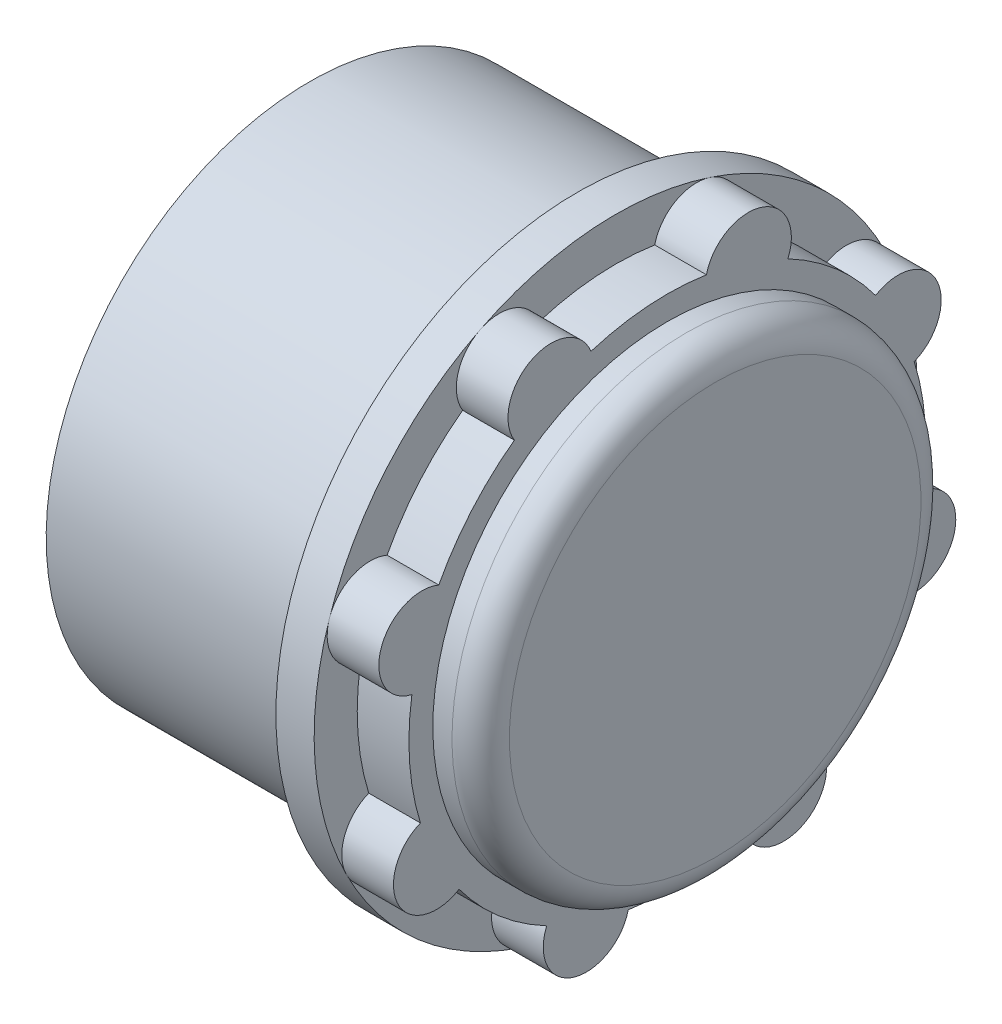
ISO-10303-21;
HEADER;
FILE_DESCRIPTION(('STEP AP214'),'2;1');
FILE_NAME('part.step','',(''),(''),'','','');
FILE_SCHEMA(('AUTOMOTIVE_DESIGN { 1 0 10303 214 1 1 1 1 }'));
ENDSEC;
DATA;
#1=APPLICATION_CONTEXT('core data for automotive mechanical design processes');
#2=APPLICATION_PROTOCOL_DEFINITION('international standard','automotive_design',2000,#1);
#3=PRODUCT_CONTEXT('',#1,'mechanical');
#4=PRODUCT('Part','Part','',(#3));
#5=PRODUCT_RELATED_PRODUCT_CATEGORY('part','',(#4));
#6=PRODUCT_DEFINITION_FORMATION('','',#4);
#7=PRODUCT_DEFINITION_CONTEXT('part definition',#1,'design');
#8=PRODUCT_DEFINITION('design','',#6,#7);
#9=PRODUCT_DEFINITION_SHAPE('','',#8);
#10=(LENGTH_UNIT() NAMED_UNIT(*) SI_UNIT(.MILLI.,.METRE.));
#11=(NAMED_UNIT(*) PLANE_ANGLE_UNIT() SI_UNIT($,.RADIAN.));
#12=(NAMED_UNIT(*) SI_UNIT($,.STERADIAN.) SOLID_ANGLE_UNIT());
#13=UNCERTAINTY_MEASURE_WITH_UNIT(LENGTH_MEASURE(1.E-05),#10,'distance_accuracy_value','');
#14=(GEOMETRIC_REPRESENTATION_CONTEXT(3) GLOBAL_UNCERTAINTY_ASSIGNED_CONTEXT((#13)) GLOBAL_UNIT_ASSIGNED_CONTEXT((#10,
#11,#12)) REPRESENTATION_CONTEXT('',''));
#15=CARTESIAN_POINT('',(0.,0.,0.));
#16=DIRECTION('',(0.,0.,1.));
#17=DIRECTION('',(1.,0.,0.));
#18=AXIS2_PLACEMENT_3D('',#15,#16,#17);
#19=CARTESIAN_POINT('',(2.,0.,0.));
#20=DIRECTION('',(1.,0.,0.));
#21=DIRECTION('',(0.,0.,-1.));
#22=AXIS2_PLACEMENT_3D('',#19,#20,#21);
#23=PLANE('',#22);
#24=CARTESIAN_POINT('',(2.,0.,0.));
#25=DIRECTION('',(1.,0.,0.));
#26=DIRECTION('',(0.,1.,0.));
#27=AXIS2_PLACEMENT_3D('',#24,#25,#26);
#28=CIRCLE('',#27,13.5);
#29=CARTESIAN_POINT('',(2.,-2.0425042619632,-13.3445935247149));
#30=VERTEX_POINT('',#29);
#31=CARTESIAN_POINT('',(2.,3.9869170359937,-12.8978483689375));
#32=VERTEX_POINT('',#31);
#33=EDGE_CURVE('E775',#30,#32,#28,.T.);
#34=ORIENTED_EDGE('',*,*,#33,.F.);
#35=CARTESIAN_POINT('',(2.,-4.23049904831431,-12.8200186350181));
#36=DIRECTION('',(1.,0.,0.));
#37=DIRECTION('',(0.,1.,0.));
#38=AXIS2_PLACEMENT_3D('',#35,#36,#37);
#39=CIRCLE('',#38,2.25);
#40=CARTESIAN_POINT('',(2.,-4.93558222303336,-14.9566884075211));
#41=VERTEX_POINT('',#40);
#42=EDGE_CURVE('E407',#41,#30,#39,.T.);
#43=ORIENTED_EDGE('',*,*,#42,.F.);
#44=CARTESIAN_POINT('',(2.,0.,0.));
#45=DIRECTION('',(1.,0.,0.));
#46=DIRECTION('',(0.,0.,-1.));
#47=AXIS2_PLACEMENT_3D('',#44,#45,#46);
#48=CIRCLE('',#47,15.75);
#49=CARTESIAN_POINT('',(2.,7.08599213804178,-14.0659594560631));
#50=VERTEX_POINT('',#49);
#51=EDGE_CURVE('E225',#41,#50,#48,.T.);
#52=ORIENTED_EDGE('',*,*,#51,.T.);
#53=CARTESIAN_POINT('',(2.,6.07370754689295,-12.0565366766255));
#54=DIRECTION('',(1.,0.,0.));
#55=DIRECTION('',(0.,1.,0.));
#56=AXIS2_PLACEMENT_3D('',#53,#54,#55);
#57=CIRCLE('',#56,2.25);
#58=EDGE_CURVE('E774',#32,#50,#57,.T.);
#59=ORIENTED_EDGE('',*,*,#58,.F.);
#60=EDGE_LOOP('',(#34,#43,#52,#59));
#61=FACE_BOUND('',#60,.T.);
#62=ADVANCED_FACE('F51',(#61),#23,.T.);
#63=CARTESIAN_POINT('',(2.,7.9917839592674,-10.8803211877406));
#64=VERTEX_POINT('',#63);
#65=EDGE_CURVE('E741',#50,#64,#57,.T.);
#66=ORIENTED_EDGE('',*,*,#65,.F.);
#67=CARTESIAN_POINT('',(2.,14.9566884075212,-4.93558222303331));
#68=VERTEX_POINT('',#67);
#69=EDGE_CURVE('E232',#50,#68,#48,.T.);
#70=ORIENTED_EDGE('',*,*,#69,.T.);
#71=CARTESIAN_POINT('',(2.,12.8200186350181,-4.23049904831426));
#72=DIRECTION('',(1.,0.,0.));
#73=DIRECTION('',(0.,1.,0.));
#74=AXIS2_PLACEMENT_3D('',#71,#72,#73);
#75=CIRCLE('',#74,2.25000000000001);
#76=CARTESIAN_POINT('',(2.,11.9393321165709,-6.30097997221221));
#77=VERTEX_POINT('',#76);
#78=EDGE_CURVE('E330',#77,#68,#75,.T.);
#79=ORIENTED_EDGE('',*,*,#78,.F.);
#80=CARTESIAN_POINT('',(2.,0.,0.));
#81=DIRECTION('',(1.,0.,0.));
#82=DIRECTION('',(0.,1.,0.));
#83=AXIS2_PLACEMENT_3D('',#80,#81,#82);
#84=CIRCLE('',#83,13.5);
#85=EDGE_CURVE('E738',#64,#77,#84,.T.);
#86=ORIENTED_EDGE('',*,*,#85,.F.);
#87=EDGE_LOOP('',(#66,#70,#79,#86));
#88=FACE_BOUND('',#87,.T.);
#89=ADVANCED_FACE('F261',(#88),#23,.T.);
#90=CARTESIAN_POINT('',(2.,-6.30097997221226,-11.9393321165708));
#91=VERTEX_POINT('',#90);
#92=EDGE_CURVE('E778',#91,#41,#39,.T.);
#93=ORIENTED_EDGE('',*,*,#92,.F.);
#94=CARTESIAN_POINT('',(2.,0.,0.));
#95=DIRECTION('',(1.,0.,0.));
#96=DIRECTION('',(0.,1.,0.));
#97=AXIS2_PLACEMENT_3D('',#94,#95,#96);
#98=CIRCLE('',#97,13.5);
#99=CARTESIAN_POINT('',(2.,-10.8803211877406,-7.99178395926736));
#100=VERTEX_POINT('',#99);
#101=EDGE_CURVE('E787',#100,#91,#98,.T.);
#102=ORIENTED_EDGE('',*,*,#101,.F.);
#103=CARTESIAN_POINT('',(2.,-12.0565366766255,-6.07370754689291));
#104=DIRECTION('',(1.,0.,0.));
#105=DIRECTION('',(0.,1.,0.));
#106=AXIS2_PLACEMENT_3D('',#103,#104,#105);
#107=CIRCLE('',#106,2.25);
#108=CARTESIAN_POINT('',(2.,-14.0659594560631,-7.08599213804173));
#109=VERTEX_POINT('',#108);
#110=EDGE_CURVE('E783',#109,#100,#107,.T.);
#111=ORIENTED_EDGE('',*,*,#110,.F.);
#112=EDGE_CURVE('E761',#109,#41,#48,.T.);
#113=ORIENTED_EDGE('',*,*,#112,.T.);
#114=EDGE_LOOP('',(#93,#102,#111,#113));
#115=FACE_BOUND('',#114,.T.);
#116=ADVANCED_FACE('F268',(#115),#23,.T.);
#117=CARTESIAN_POINT('',(2.,-12.8978483689375,-3.98691703599366));
#118=VERTEX_POINT('',#117);
#119=EDGE_CURVE('E792',#118,#109,#107,.T.);
#120=ORIENTED_EDGE('',*,*,#119,.F.);
#121=CARTESIAN_POINT('',(2.,0.,0.));
#122=DIRECTION('',(1.,0.,0.));
#123=DIRECTION('',(0.,1.,0.));
#124=AXIS2_PLACEMENT_3D('',#121,#122,#123);
#125=CIRCLE('',#124,13.5);
#126=CARTESIAN_POINT('',(2.,-13.3445935247149,2.04250426196324));
#127=VERTEX_POINT('',#126);
#128=EDGE_CURVE('E798',#127,#118,#125,.T.);
#129=ORIENTED_EDGE('',*,*,#128,.F.);
#130=CARTESIAN_POINT('',(2.,-12.8200186350181,4.23049904831435));
#131=DIRECTION('',(1.,0.,0.));
#132=DIRECTION('',(0.,1.,0.));
#133=AXIS2_PLACEMENT_3D('',#130,#131,#132);
#134=CIRCLE('',#133,2.25);
#135=CARTESIAN_POINT('',(2.00000000000001,-14.9566884075211,4.93558222303341));
#136=VERTEX_POINT('',#135);
#137=EDGE_CURVE('E328',#136,#127,#134,.T.);
#138=ORIENTED_EDGE('',*,*,#137,.F.);
#139=EDGE_CURVE('E756',#136,#109,#48,.T.);
#140=ORIENTED_EDGE('',*,*,#139,.T.);
#141=EDGE_LOOP('',(#120,#129,#138,#140));
#142=FACE_BOUND('',#141,.T.);
#143=ADVANCED_FACE('F681',(#142),#23,.T.);
#144=CARTESIAN_POINT('',(2.,13.3445935247149,-2.04250426196314));
#145=VERTEX_POINT('',#144);
#146=EDGE_CURVE('E319',#68,#145,#75,.T.);
#147=ORIENTED_EDGE('',*,*,#146,.F.);
#148=CARTESIAN_POINT('',(2.,14.0659594560631,7.08599213804183));
#149=VERTEX_POINT('',#148);
#150=EDGE_CURVE('E235',#68,#149,#48,.T.);
#151=ORIENTED_EDGE('',*,*,#150,.T.);
#152=CARTESIAN_POINT('',(2.,12.0565366766255,6.07370754689299));
#153=DIRECTION('',(1.,0.,0.));
#154=DIRECTION('',(0.,1.,0.));
#155=AXIS2_PLACEMENT_3D('',#152,#153,#154);
#156=CIRCLE('',#155,2.25);
#157=CARTESIAN_POINT('',(2.,12.8978483689375,3.98691703599376));
#158=VERTEX_POINT('',#157);
#159=EDGE_CURVE('E340',#158,#149,#156,.T.);
#160=ORIENTED_EDGE('',*,*,#159,.F.);
#161=CARTESIAN_POINT('',(2.,0.,0.));
#162=DIRECTION('',(1.,0.,0.));
#163=DIRECTION('',(0.,1.,0.));
#164=AXIS2_PLACEMENT_3D('',#161,#162,#163);
#165=CIRCLE('',#164,13.5);
#166=EDGE_CURVE('E212',#145,#158,#165,.T.);
#167=ORIENTED_EDGE('',*,*,#166,.F.);
#168=EDGE_LOOP('',(#147,#151,#160,#167));
#169=FACE_BOUND('',#168,.T.);
#170=ADVANCED_FACE('F291',(#169),#23,.T.);
#171=CARTESIAN_POINT('',(2.,-11.9393321165708,6.30097997221228));
#172=VERTEX_POINT('',#171);
#173=EDGE_CURVE('E314',#172,#136,#134,.T.);
#174=ORIENTED_EDGE('',*,*,#173,.F.);
#175=CARTESIAN_POINT('',(2.,0.,0.));
#176=DIRECTION('',(1.,0.,0.));
#177=DIRECTION('',(0.,1.,0.));
#178=AXIS2_PLACEMENT_3D('',#175,#176,#177);
#179=CIRCLE('',#178,13.5);
#180=CARTESIAN_POINT('',(2.,-7.99178395926732,10.8803211877406));
#181=VERTEX_POINT('',#180);
#182=EDGE_CURVE('E306',#181,#172,#179,.T.);
#183=ORIENTED_EDGE('',*,*,#182,.F.);
#184=CARTESIAN_POINT('',(2.,-6.07370754689287,12.0565366766255));
#185=DIRECTION('',(1.,0.,0.));
#186=DIRECTION('',(0.,1.,0.));
#187=AXIS2_PLACEMENT_3D('',#184,#185,#186);
#188=CIRCLE('',#187,2.25);
#189=CARTESIAN_POINT('',(2.,-7.08599213804168,14.0659594560631));
#190=VERTEX_POINT('',#189);
#191=EDGE_CURVE('E308',#190,#181,#188,.T.);
#192=ORIENTED_EDGE('',*,*,#191,.F.);
#193=EDGE_CURVE('E753',#190,#136,#48,.T.);
#194=ORIENTED_EDGE('',*,*,#193,.T.);
#195=EDGE_LOOP('',(#174,#183,#192,#194));
#196=FACE_BOUND('',#195,.T.);
#197=ADVANCED_FACE('F286',(#196),#23,.T.);
#198=CARTESIAN_POINT('',(2.,-3.98691703599362,12.8978483689375));
#199=VERTEX_POINT('',#198);
#200=EDGE_CURVE('E296',#199,#190,#188,.T.);
#201=ORIENTED_EDGE('',*,*,#200,.F.);
#202=CARTESIAN_POINT('',(2.,0.,0.));
#203=DIRECTION('',(1.,0.,0.));
#204=DIRECTION('',(0.,1.,0.));
#205=AXIS2_PLACEMENT_3D('',#202,#203,#204);
#206=CIRCLE('',#205,13.5);
#207=CARTESIAN_POINT('',(2.,2.04250426196328,13.3445935247149));
#208=VERTEX_POINT('',#207);
#209=EDGE_CURVE('E299',#208,#199,#206,.T.);
#210=ORIENTED_EDGE('',*,*,#209,.F.);
#211=CARTESIAN_POINT('',(2.,4.2304990483144,12.8200186350181));
#212=DIRECTION('',(1.,0.,0.));
#213=DIRECTION('',(0.,1.,0.));
#214=AXIS2_PLACEMENT_3D('',#211,#212,#213);
#215=CIRCLE('',#214,2.25000000000001);
#216=CARTESIAN_POINT('',(2.,4.93558222303346,14.9566884075211));
#217=VERTEX_POINT('',#216);
#218=EDGE_CURVE('E320',#217,#208,#215,.T.);
#219=ORIENTED_EDGE('',*,*,#218,.F.);
#220=EDGE_CURVE('E301',#217,#190,#48,.T.);
#221=ORIENTED_EDGE('',*,*,#220,.T.);
#222=EDGE_LOOP('',(#201,#210,#219,#221));
#223=FACE_BOUND('',#222,.T.);
#224=ADVANCED_FACE('F277',(#223),#23,.T.);
#225=CARTESIAN_POINT('',(2.,0.,0.));
#226=DIRECTION('',(-1.,0.,0.));
#227=DIRECTION('',(0.,0.,1.));
#228=AXIS2_PLACEMENT_3D('',#225,#226,#227);
#229=CYLINDRICAL_SURFACE('',#228,15.75);
#230=ORIENTED_EDGE('',*,*,#69,.F.);
#231=ORIENTED_EDGE('',*,*,#51,.F.);
#232=ORIENTED_EDGE('',*,*,#112,.F.);
#233=ORIENTED_EDGE('',*,*,#139,.F.);
#234=ORIENTED_EDGE('',*,*,#193,.F.);
#235=ORIENTED_EDGE('',*,*,#220,.F.);
#236=EDGE_CURVE('E747',#149,#217,#48,.T.);
#237=ORIENTED_EDGE('',*,*,#236,.F.);
#238=ORIENTED_EDGE('',*,*,#150,.F.);
#239=EDGE_LOOP('',(#230,#231,#232,#233,#234,#235,#237,#238));
#240=FACE_BOUND('',#239,.T.);
#241=CARTESIAN_POINT('',(0.,0.,0.));
#242=DIRECTION('',(1.,0.,0.));
#243=DIRECTION('',(0.,0.,-1.));
#244=AXIS2_PLACEMENT_3D('',#241,#242,#243);
#245=CIRCLE('',#244,15.75);
#246=CARTESIAN_POINT('',(0.,0.,-15.75));
#247=VERTEX_POINT('',#246);
#248=EDGE_CURVE('E219',#247,#247,#245,.T.);
#249=ORIENTED_EDGE('',*,*,#248,.T.);
#250=EDGE_LOOP('',(#249));
#251=FACE_BOUND('',#250,.T.);
#252=ADVANCED_FACE('F275',(#240,#251),#229,.T.);
#253=CARTESIAN_POINT('',(2.,10.8803211877405,7.99178395926743));
#254=VERTEX_POINT('',#253);
#255=EDGE_CURVE('E217',#149,#254,#156,.T.);
#256=ORIENTED_EDGE('',*,*,#255,.F.);
#257=ORIENTED_EDGE('',*,*,#236,.T.);
#258=CARTESIAN_POINT('',(2.,6.30097997221233,11.9393321165708));
#259=VERTEX_POINT('',#258);
#260=EDGE_CURVE('E317',#259,#217,#215,.T.);
#261=ORIENTED_EDGE('',*,*,#260,.F.);
#262=CARTESIAN_POINT('',(2.,0.,0.));
#263=DIRECTION('',(1.,0.,0.));
#264=DIRECTION('',(0.,1.,0.));
#265=AXIS2_PLACEMENT_3D('',#262,#263,#264);
#266=CIRCLE('',#265,13.5);
#267=EDGE_CURVE('E342',#254,#259,#266,.T.);
#268=ORIENTED_EDGE('',*,*,#267,.F.);
#269=EDGE_LOOP('',(#256,#257,#261,#268));
#270=FACE_BOUND('',#269,.T.);
#271=ADVANCED_FACE('F264',(#270),#23,.T.);
#272=CARTESIAN_POINT('',(0.,0.,0.));
#273=DIRECTION('',(1.,0.,0.));
#274=DIRECTION('',(0.,0.,-1.));
#275=AXIS2_PLACEMENT_3D('',#272,#273,#274);
#276=PLANE('',#275);
#277=CARTESIAN_POINT('',(0.,0.,0.));
#278=DIRECTION('',(-1.,0.,0.));
#279=DIRECTION('',(0.,-1.,0.));
#280=AXIS2_PLACEMENT_3D('',#277,#278,#279);
#281=CIRCLE('',#280,13.75);
#282=CARTESIAN_POINT('',(0.,-13.75,0.));
#283=VERTEX_POINT('',#282);
#284=EDGE_CURVE('E242',#283,#283,#281,.T.);
#285=ORIENTED_EDGE('',*,*,#284,.F.);
#286=EDGE_LOOP('',(#285));
#287=FACE_BOUND('',#286,.T.);
#288=ORIENTED_EDGE('',*,*,#248,.F.);
#289=EDGE_LOOP('',(#288));
#290=FACE_BOUND('',#289,.T.);
#291=ADVANCED_FACE('F274',(#287,#290),#276,.F.);
#292=CARTESIAN_POINT('',(4.7,12.0565366766255,6.07370754689299));
#293=DIRECTION('',(-1.,0.,0.));
#294=DIRECTION('',(0.,-1.,0.));
#295=AXIS2_PLACEMENT_3D('',#292,#293,#294);
#296=CYLINDRICAL_SURFACE('',#295,2.25);
#297=ORIENTED_EDGE('',*,*,#159,.T.);
#298=ORIENTED_EDGE('',*,*,#255,.T.);
#299=DIRECTION('',(-1.,0.,0.));
#300=VECTOR('',#299,1.);
#301=CARTESIAN_POINT('',(4.7,10.8803211877405,7.99178395926743));
#302=LINE('',#301,#300);
#303=CARTESIAN_POINT('',(4.7,10.8803211877405,7.99178395926743));
#304=VERTEX_POINT('',#303);
#305=EDGE_CURVE('E196',#304,#254,#302,.T.);
#306=ORIENTED_EDGE('',*,*,#305,.F.);
#307=CARTESIAN_POINT('',(4.7,12.0565366766255,6.07370754689299));
#308=DIRECTION('',(1.,0.,0.));
#309=DIRECTION('',(0.,1.,0.));
#310=AXIS2_PLACEMENT_3D('',#307,#308,#309);
#311=CIRCLE('',#310,2.25);
#312=CARTESIAN_POINT('',(4.7,12.8978483689375,3.98691703599376));
#313=VERTEX_POINT('',#312);
#314=EDGE_CURVE('E203',#313,#304,#311,.T.);
#315=ORIENTED_EDGE('',*,*,#314,.F.);
#316=DIRECTION('',(-1.,0.,0.));
#317=VECTOR('',#316,1.);
#318=CARTESIAN_POINT('',(4.7,12.8978483689375,3.98691703599376));
#319=LINE('',#318,#317);
#320=EDGE_CURVE('E354',#313,#158,#319,.T.);
#321=ORIENTED_EDGE('',*,*,#320,.T.);
#322=EDGE_LOOP('',(#297,#298,#306,#315,#321));
#323=FACE_BOUND('',#322,.T.);
#324=ADVANCED_FACE('F216',(#323),#296,.T.);
#325=CARTESIAN_POINT('',(4.7,0.,0.));
#326=DIRECTION('',(-1.,0.,0.));
#327=DIRECTION('',(0.,-1.,0.));
#328=AXIS2_PLACEMENT_3D('',#325,#326,#327);
#329=CYLINDRICAL_SURFACE('',#328,13.5);
#330=ORIENTED_EDGE('',*,*,#267,.T.);
#331=DIRECTION('',(-1.,0.,0.));
#332=VECTOR('',#331,1.);
#333=CARTESIAN_POINT('',(4.7,6.30097997221233,11.9393321165708));
#334=LINE('',#333,#332);
#335=CARTESIAN_POINT('',(4.7,6.30097997221233,11.9393321165708));
#336=VERTEX_POINT('',#335);
#337=EDGE_CURVE('E198',#336,#259,#334,.T.);
#338=ORIENTED_EDGE('',*,*,#337,.F.);
#339=CARTESIAN_POINT('',(4.7,0.,0.));
#340=DIRECTION('',(1.,0.,0.));
#341=DIRECTION('',(0.,1.,0.));
#342=AXIS2_PLACEMENT_3D('',#339,#340,#341);
#343=CIRCLE('',#342,13.5);
#344=EDGE_CURVE('E191',#304,#336,#343,.T.);
#345=ORIENTED_EDGE('',*,*,#344,.F.);
#346=ORIENTED_EDGE('',*,*,#305,.T.);
#347=EDGE_LOOP('',(#330,#338,#345,#346));
#348=FACE_BOUND('',#347,.T.);
#349=ADVANCED_FACE('F194',(#348),#329,.T.);
#350=CARTESIAN_POINT('',(4.7,4.2304990483144,12.8200186350181));
#351=DIRECTION('',(-1.,0.,0.));
#352=DIRECTION('',(0.,-1.,0.));
#353=AXIS2_PLACEMENT_3D('',#350,#351,#352);
#354=CYLINDRICAL_SURFACE('',#353,2.25000000000001);
#355=ORIENTED_EDGE('',*,*,#260,.T.);
#356=ORIENTED_EDGE('',*,*,#218,.T.);
#357=DIRECTION('',(-1.,0.,0.));
#358=VECTOR('',#357,1.);
#359=CARTESIAN_POINT('',(4.7,2.04250426196328,13.3445935247149));
#360=LINE('',#359,#358);
#361=CARTESIAN_POINT('',(4.7,2.04250426196328,13.3445935247149));
#362=VERTEX_POINT('',#361);
#363=EDGE_CURVE('E228',#362,#208,#360,.T.);
#364=ORIENTED_EDGE('',*,*,#363,.F.);
#365=CARTESIAN_POINT('',(4.7,4.2304990483144,12.8200186350181));
#366=DIRECTION('',(1.,0.,0.));
#367=DIRECTION('',(0.,1.,0.));
#368=AXIS2_PLACEMENT_3D('',#365,#366,#367);
#369=CIRCLE('',#368,2.25000000000001);
#370=EDGE_CURVE('E202',#336,#362,#369,.T.);
#371=ORIENTED_EDGE('',*,*,#370,.F.);
#372=ORIENTED_EDGE('',*,*,#337,.T.);
#373=EDGE_LOOP('',(#355,#356,#364,#371,#372));
#374=FACE_BOUND('',#373,.T.);
#375=ADVANCED_FACE('F499',(#374),#354,.T.);
#376=CARTESIAN_POINT('',(4.7,0.,0.));
#377=DIRECTION('',(-1.,0.,0.));
#378=DIRECTION('',(0.,-1.,0.));
#379=AXIS2_PLACEMENT_3D('',#376,#377,#378);
#380=CYLINDRICAL_SURFACE('',#379,13.5);
#381=ORIENTED_EDGE('',*,*,#209,.T.);
#382=DIRECTION('',(-1.,0.,0.));
#383=VECTOR('',#382,1.);
#384=CARTESIAN_POINT('',(4.7,-3.98691703599362,12.8978483689375));
#385=LINE('',#384,#383);
#386=CARTESIAN_POINT('',(4.7,-3.98691703599362,12.8978483689375));
#387=VERTEX_POINT('',#386);
#388=EDGE_CURVE('E832',#387,#199,#385,.T.);
#389=ORIENTED_EDGE('',*,*,#388,.F.);
#390=CARTESIAN_POINT('',(4.7,0.,0.));
#391=DIRECTION('',(1.,0.,0.));
#392=DIRECTION('',(0.,1.,0.));
#393=AXIS2_PLACEMENT_3D('',#390,#391,#392);
#394=CIRCLE('',#393,13.5);
#395=EDGE_CURVE('E398',#362,#387,#394,.T.);
#396=ORIENTED_EDGE('',*,*,#395,.F.);
#397=ORIENTED_EDGE('',*,*,#363,.T.);
#398=EDGE_LOOP('',(#381,#389,#396,#397));
#399=FACE_BOUND('',#398,.T.);
#400=ADVANCED_FACE('F496',(#399),#380,.T.);
#401=CARTESIAN_POINT('',(4.7,-6.07370754689287,12.0565366766255));
#402=DIRECTION('',(-1.,0.,0.));
#403=DIRECTION('',(0.,-1.,0.));
#404=AXIS2_PLACEMENT_3D('',#401,#402,#403);
#405=CYLINDRICAL_SURFACE('',#404,2.25);
#406=ORIENTED_EDGE('',*,*,#200,.T.);
#407=ORIENTED_EDGE('',*,*,#191,.T.);
#408=DIRECTION('',(-1.,0.,0.));
#409=VECTOR('',#408,1.);
#410=CARTESIAN_POINT('',(4.7,-7.99178395926732,10.8803211877406));
#411=LINE('',#410,#409);
#412=CARTESIAN_POINT('',(4.7,-7.99178395926732,10.8803211877406));
#413=VERTEX_POINT('',#412);
#414=EDGE_CURVE('E825',#413,#181,#411,.T.);
#415=ORIENTED_EDGE('',*,*,#414,.F.);
#416=CARTESIAN_POINT('',(4.7,-6.07370754689287,12.0565366766255));
#417=DIRECTION('',(1.,0.,0.));
#418=DIRECTION('',(0.,1.,0.));
#419=AXIS2_PLACEMENT_3D('',#416,#417,#418);
#420=CIRCLE('',#419,2.25);
#421=EDGE_CURVE('E394',#387,#413,#420,.T.);
#422=ORIENTED_EDGE('',*,*,#421,.F.);
#423=ORIENTED_EDGE('',*,*,#388,.T.);
#424=EDGE_LOOP('',(#406,#407,#415,#422,#423));
#425=FACE_BOUND('',#424,.T.);
#426=ADVANCED_FACE('F492',(#425),#405,.T.);
#427=CARTESIAN_POINT('',(4.7,0.,0.));
#428=DIRECTION('',(-1.,0.,0.));
#429=DIRECTION('',(0.,-1.,0.));
#430=AXIS2_PLACEMENT_3D('',#427,#428,#429);
#431=CYLINDRICAL_SURFACE('',#430,13.5);
#432=ORIENTED_EDGE('',*,*,#182,.T.);
#433=DIRECTION('',(-1.,0.,0.));
#434=VECTOR('',#433,1.);
#435=CARTESIAN_POINT('',(4.7,-11.9393321165708,6.30097997221228));
#436=LINE('',#435,#434);
#437=CARTESIAN_POINT('',(4.7,-11.9393321165708,6.30097997221228));
#438=VERTEX_POINT('',#437);
#439=EDGE_CURVE('E821',#438,#172,#436,.T.);
#440=ORIENTED_EDGE('',*,*,#439,.F.);
#441=CARTESIAN_POINT('',(4.7,0.,0.));
#442=DIRECTION('',(1.,0.,0.));
#443=DIRECTION('',(0.,1.,0.));
#444=AXIS2_PLACEMENT_3D('',#441,#442,#443);
#445=CIRCLE('',#444,13.5);
#446=EDGE_CURVE('E390',#413,#438,#445,.T.);
#447=ORIENTED_EDGE('',*,*,#446,.F.);
#448=ORIENTED_EDGE('',*,*,#414,.T.);
#449=EDGE_LOOP('',(#432,#440,#447,#448));
#450=FACE_BOUND('',#449,.T.);
#451=ADVANCED_FACE('F488',(#450),#431,.T.);
#452=CARTESIAN_POINT('',(4.70000000000001,-12.8200186350181,4.23049904831435));
#453=DIRECTION('',(-1.,0.,0.));
#454=DIRECTION('',(0.,-1.,0.));
#455=AXIS2_PLACEMENT_3D('',#452,#453,#454);
#456=CYLINDRICAL_SURFACE('',#455,2.25);
#457=ORIENTED_EDGE('',*,*,#173,.T.);
#458=ORIENTED_EDGE('',*,*,#137,.T.);
#459=DIRECTION('',(-1.,0.,0.));
#460=VECTOR('',#459,1.);
#461=CARTESIAN_POINT('',(4.7,-13.3445935247149,2.04250426196324));
#462=LINE('',#461,#460);
#463=CARTESIAN_POINT('',(4.7,-13.3445935247149,2.04250426196324));
#464=VERTEX_POINT('',#463);
#465=EDGE_CURVE('E820',#464,#127,#462,.T.);
#466=ORIENTED_EDGE('',*,*,#465,.F.);
#467=CARTESIAN_POINT('',(4.70000000000001,-12.8200186350181,4.23049904831435));
#468=DIRECTION('',(1.,0.,0.));
#469=DIRECTION('',(0.,1.,0.));
#470=AXIS2_PLACEMENT_3D('',#467,#468,#469);
#471=CIRCLE('',#470,2.25);
#472=EDGE_CURVE('E386',#438,#464,#471,.T.);
#473=ORIENTED_EDGE('',*,*,#472,.F.);
#474=ORIENTED_EDGE('',*,*,#439,.T.);
#475=EDGE_LOOP('',(#457,#458,#466,#473,#474));
#476=FACE_BOUND('',#475,.T.);
#477=ADVANCED_FACE('F484',(#476),#456,.T.);
#478=CARTESIAN_POINT('',(4.7,0.,0.));
#479=DIRECTION('',(-1.,0.,0.));
#480=DIRECTION('',(0.,-1.,0.));
#481=AXIS2_PLACEMENT_3D('',#478,#479,#480);
#482=CYLINDRICAL_SURFACE('',#481,13.5);
#483=ORIENTED_EDGE('',*,*,#128,.T.);
#484=DIRECTION('',(-1.,0.,0.));
#485=VECTOR('',#484,1.);
#486=CARTESIAN_POINT('',(4.7,-12.8978483689375,-3.98691703599366));
#487=LINE('',#486,#485);
#488=CARTESIAN_POINT('',(4.7,-12.8978483689375,-3.98691703599366));
#489=VERTEX_POINT('',#488);
#490=EDGE_CURVE('E819',#489,#118,#487,.T.);
#491=ORIENTED_EDGE('',*,*,#490,.F.);
#492=CARTESIAN_POINT('',(4.7,0.,0.));
#493=DIRECTION('',(1.,0.,0.));
#494=DIRECTION('',(0.,1.,0.));
#495=AXIS2_PLACEMENT_3D('',#492,#493,#494);
#496=CIRCLE('',#495,13.5);
#497=EDGE_CURVE('E382',#464,#489,#496,.T.);
#498=ORIENTED_EDGE('',*,*,#497,.F.);
#499=ORIENTED_EDGE('',*,*,#465,.T.);
#500=EDGE_LOOP('',(#483,#491,#498,#499));
#501=FACE_BOUND('',#500,.T.);
#502=ADVANCED_FACE('F480',(#501),#482,.T.);
#503=CARTESIAN_POINT('',(4.7,-12.0565366766255,-6.07370754689291));
#504=DIRECTION('',(-1.,0.,0.));
#505=DIRECTION('',(0.,-1.,0.));
#506=AXIS2_PLACEMENT_3D('',#503,#504,#505);
#507=CYLINDRICAL_SURFACE('',#506,2.25);
#508=ORIENTED_EDGE('',*,*,#119,.T.);
#509=ORIENTED_EDGE('',*,*,#110,.T.);
#510=DIRECTION('',(-1.,0.,0.));
#511=VECTOR('',#510,1.);
#512=CARTESIAN_POINT('',(4.7,-10.8803211877406,-7.99178395926736));
#513=LINE('',#512,#511);
#514=CARTESIAN_POINT('',(4.7,-10.8803211877406,-7.99178395926736));
#515=VERTEX_POINT('',#514);
#516=EDGE_CURVE('E817',#515,#100,#513,.T.);
#517=ORIENTED_EDGE('',*,*,#516,.F.);
#518=CARTESIAN_POINT('',(4.7,-12.0565366766255,-6.07370754689291));
#519=DIRECTION('',(1.,0.,0.));
#520=DIRECTION('',(0.,1.,0.));
#521=AXIS2_PLACEMENT_3D('',#518,#519,#520);
#522=CIRCLE('',#521,2.25);
#523=EDGE_CURVE('E378',#489,#515,#522,.T.);
#524=ORIENTED_EDGE('',*,*,#523,.F.);
#525=ORIENTED_EDGE('',*,*,#490,.T.);
#526=EDGE_LOOP('',(#508,#509,#517,#524,#525));
#527=FACE_BOUND('',#526,.T.);
#528=ADVANCED_FACE('F476',(#527),#507,.T.);
#529=CARTESIAN_POINT('',(4.7,0.,0.));
#530=DIRECTION('',(-1.,0.,0.));
#531=DIRECTION('',(0.,-1.,0.));
#532=AXIS2_PLACEMENT_3D('',#529,#530,#531);
#533=CYLINDRICAL_SURFACE('',#532,13.5);
#534=ORIENTED_EDGE('',*,*,#101,.T.);
#535=DIRECTION('',(-1.,0.,0.));
#536=VECTOR('',#535,1.);
#537=CARTESIAN_POINT('',(4.7,-6.30097997221226,-11.9393321165708));
#538=LINE('',#537,#536);
#539=CARTESIAN_POINT('',(4.7,-6.30097997221226,-11.9393321165708));
#540=VERTEX_POINT('',#539);
#541=EDGE_CURVE('E837',#540,#91,#538,.T.);
#542=ORIENTED_EDGE('',*,*,#541,.F.);
#543=CARTESIAN_POINT('',(4.7,0.,0.));
#544=DIRECTION('',(1.,0.,0.));
#545=DIRECTION('',(0.,1.,0.));
#546=AXIS2_PLACEMENT_3D('',#543,#544,#545);
#547=CIRCLE('',#546,13.5);
#548=EDGE_CURVE('E374',#515,#540,#547,.T.);
#549=ORIENTED_EDGE('',*,*,#548,.F.);
#550=ORIENTED_EDGE('',*,*,#516,.T.);
#551=EDGE_LOOP('',(#534,#542,#549,#550));
#552=FACE_BOUND('',#551,.T.);
#553=ADVANCED_FACE('F472',(#552),#533,.T.);
#554=CARTESIAN_POINT('',(4.7,-4.23049904831431,-12.8200186350181));
#555=DIRECTION('',(-1.,0.,0.));
#556=DIRECTION('',(0.,-1.,0.));
#557=AXIS2_PLACEMENT_3D('',#554,#555,#556);
#558=CYLINDRICAL_SURFACE('',#557,2.25);
#559=ORIENTED_EDGE('',*,*,#92,.T.);
#560=ORIENTED_EDGE('',*,*,#42,.T.);
#561=DIRECTION('',(-1.,0.,0.));
#562=VECTOR('',#561,1.);
#563=CARTESIAN_POINT('',(4.7,-2.0425042619632,-13.3445935247149));
#564=LINE('',#563,#562);
#565=CARTESIAN_POINT('',(4.7,-2.0425042619632,-13.3445935247149));
#566=VERTEX_POINT('',#565);
#567=EDGE_CURVE('E67',#566,#30,#564,.T.);
#568=ORIENTED_EDGE('',*,*,#567,.F.);
#569=CARTESIAN_POINT('',(4.7,-4.23049904831431,-12.8200186350181));
#570=DIRECTION('',(1.,0.,0.));
#571=DIRECTION('',(0.,1.,0.));
#572=AXIS2_PLACEMENT_3D('',#569,#570,#571);
#573=CIRCLE('',#572,2.25);
#574=EDGE_CURVE('E370',#540,#566,#573,.T.);
#575=ORIENTED_EDGE('',*,*,#574,.F.);
#576=ORIENTED_EDGE('',*,*,#541,.T.);
#577=EDGE_LOOP('',(#559,#560,#568,#575,#576));
#578=FACE_BOUND('',#577,.T.);
#579=ADVANCED_FACE('F469',(#578),#558,.T.);
#580=CARTESIAN_POINT('',(4.7,0.,0.));
#581=DIRECTION('',(-1.,0.,0.));
#582=DIRECTION('',(0.,-1.,0.));
#583=AXIS2_PLACEMENT_3D('',#580,#581,#582);
#584=CYLINDRICAL_SURFACE('',#583,13.5);
#585=ORIENTED_EDGE('',*,*,#33,.T.);
#586=DIRECTION('',(-1.,0.,0.));
#587=VECTOR('',#586,1.);
#588=CARTESIAN_POINT('',(4.7,3.9869170359937,-12.8978483689375));
#589=LINE('',#588,#587);
#590=CARTESIAN_POINT('',(4.7,3.9869170359937,-12.8978483689375));
#591=VERTEX_POINT('',#590);
#592=EDGE_CURVE('E75',#591,#32,#589,.T.);
#593=ORIENTED_EDGE('',*,*,#592,.F.);
#594=CARTESIAN_POINT('',(4.7,0.,0.));
#595=DIRECTION('',(1.,0.,0.));
#596=DIRECTION('',(0.,1.,0.));
#597=AXIS2_PLACEMENT_3D('',#594,#595,#596);
#598=CIRCLE('',#597,13.5);
#599=EDGE_CURVE('E366',#566,#591,#598,.T.);
#600=ORIENTED_EDGE('',*,*,#599,.F.);
#601=ORIENTED_EDGE('',*,*,#567,.T.);
#602=EDGE_LOOP('',(#585,#593,#600,#601));
#603=FACE_BOUND('',#602,.T.);
#604=ADVANCED_FACE('F466',(#603),#584,.T.);
#605=CARTESIAN_POINT('',(4.7,6.07370754689295,-12.0565366766255));
#606=DIRECTION('',(-1.,0.,0.));
#607=DIRECTION('',(0.,-1.,0.));
#608=AXIS2_PLACEMENT_3D('',#605,#606,#607);
#609=CYLINDRICAL_SURFACE('',#608,2.25);
#610=ORIENTED_EDGE('',*,*,#58,.T.);
#611=ORIENTED_EDGE('',*,*,#65,.T.);
#612=DIRECTION('',(-1.,0.,0.));
#613=VECTOR('',#612,1.);
#614=CARTESIAN_POINT('',(4.7,7.9917839592674,-10.8803211877406));
#615=LINE('',#614,#613);
#616=CARTESIAN_POINT('',(4.7,7.9917839592674,-10.8803211877406));
#617=VERTEX_POINT('',#616);
#618=EDGE_CURVE('E844',#617,#64,#615,.T.);
#619=ORIENTED_EDGE('',*,*,#618,.F.);
#620=CARTESIAN_POINT('',(4.7,6.07370754689295,-12.0565366766255));
#621=DIRECTION('',(1.,0.,0.));
#622=DIRECTION('',(0.,1.,0.));
#623=AXIS2_PLACEMENT_3D('',#620,#621,#622);
#624=CIRCLE('',#623,2.25);
#625=EDGE_CURVE('E362',#591,#617,#624,.T.);
#626=ORIENTED_EDGE('',*,*,#625,.F.);
#627=ORIENTED_EDGE('',*,*,#592,.T.);
#628=EDGE_LOOP('',(#610,#611,#619,#626,#627));
#629=FACE_BOUND('',#628,.T.);
#630=ADVANCED_FACE('F462',(#629),#609,.T.);
#631=CARTESIAN_POINT('',(4.7,0.,0.));
#632=DIRECTION('',(-1.,0.,0.));
#633=DIRECTION('',(0.,-1.,0.));
#634=AXIS2_PLACEMENT_3D('',#631,#632,#633);
#635=CYLINDRICAL_SURFACE('',#634,13.5);
#636=ORIENTED_EDGE('',*,*,#85,.T.);
#637=DIRECTION('',(-1.,0.,0.));
#638=VECTOR('',#637,1.);
#639=CARTESIAN_POINT('',(4.7,11.9393321165709,-6.30097997221221));
#640=LINE('',#639,#638);
#641=CARTESIAN_POINT('',(4.7,11.9393321165709,-6.30097997221221));
#642=VERTEX_POINT('',#641);
#643=EDGE_CURVE('E734',#642,#77,#640,.T.);
#644=ORIENTED_EDGE('',*,*,#643,.F.);
#645=CARTESIAN_POINT('',(4.7,0.,0.));
#646=DIRECTION('',(1.,0.,0.));
#647=DIRECTION('',(0.,1.,0.));
#648=AXIS2_PLACEMENT_3D('',#645,#646,#647);
#649=CIRCLE('',#648,13.5);
#650=EDGE_CURVE('E358',#617,#642,#649,.T.);
#651=ORIENTED_EDGE('',*,*,#650,.F.);
#652=ORIENTED_EDGE('',*,*,#618,.T.);
#653=EDGE_LOOP('',(#636,#644,#651,#652));
#654=FACE_BOUND('',#653,.T.);
#655=ADVANCED_FACE('F458',(#654),#635,.T.);
#656=CARTESIAN_POINT('',(4.7,12.8200186350181,-4.23049904831426));
#657=DIRECTION('',(-1.,0.,0.));
#658=DIRECTION('',(0.,-1.,0.));
#659=AXIS2_PLACEMENT_3D('',#656,#657,#658);
#660=CYLINDRICAL_SURFACE('',#659,2.25000000000001);
#661=ORIENTED_EDGE('',*,*,#78,.T.);
#662=ORIENTED_EDGE('',*,*,#146,.T.);
#663=DIRECTION('',(-1.,0.,0.));
#664=VECTOR('',#663,1.);
#665=CARTESIAN_POINT('',(4.7,13.3445935247149,-2.04250426196314));
#666=LINE('',#665,#664);
#667=CARTESIAN_POINT('',(4.7,13.3445935247149,-2.04250426196314));
#668=VERTEX_POINT('',#667);
#669=EDGE_CURVE('E849',#668,#145,#666,.T.);
#670=ORIENTED_EDGE('',*,*,#669,.F.);
#671=CARTESIAN_POINT('',(4.7,12.8200186350181,-4.23049904831426));
#672=DIRECTION('',(1.,0.,0.));
#673=DIRECTION('',(0.,1.,0.));
#674=AXIS2_PLACEMENT_3D('',#671,#672,#673);
#675=CIRCLE('',#674,2.25000000000001);
#676=EDGE_CURVE('E355',#642,#668,#675,.T.);
#677=ORIENTED_EDGE('',*,*,#676,.F.);
#678=ORIENTED_EDGE('',*,*,#643,.T.);
#679=EDGE_LOOP('',(#661,#662,#670,#677,#678));
#680=FACE_BOUND('',#679,.T.);
#681=ADVANCED_FACE('F454',(#680),#660,.T.);
#682=CARTESIAN_POINT('',(4.7,0.,0.));
#683=DIRECTION('',(-1.,0.,0.));
#684=DIRECTION('',(0.,-1.,0.));
#685=AXIS2_PLACEMENT_3D('',#682,#683,#684);
#686=CYLINDRICAL_SURFACE('',#685,13.5);
#687=ORIENTED_EDGE('',*,*,#166,.T.);
#688=ORIENTED_EDGE('',*,*,#320,.F.);
#689=CARTESIAN_POINT('',(4.7,0.,0.));
#690=DIRECTION('',(1.,0.,0.));
#691=DIRECTION('',(0.,1.,0.));
#692=AXIS2_PLACEMENT_3D('',#689,#690,#691);
#693=CIRCLE('',#692,13.5);
#694=EDGE_CURVE('E208',#668,#313,#693,.T.);
#695=ORIENTED_EDGE('',*,*,#694,.F.);
#696=ORIENTED_EDGE('',*,*,#669,.T.);
#697=EDGE_LOOP('',(#687,#688,#695,#696));
#698=FACE_BOUND('',#697,.T.);
#699=ADVANCED_FACE('F450',(#698),#686,.T.);
#700=CARTESIAN_POINT('',(4.7,6.02826833831273,3.0368537734465));
#701=DIRECTION('',(1.,0.,0.));
#702=DIRECTION('',(0.,1.,0.));
#703=AXIS2_PLACEMENT_3D('',#700,#701,#702);
#704=PLANE('',#703);
#705=CARTESIAN_POINT('',(4.7,0.,0.));
#706=DIRECTION('',(1.,0.,0.));
#707=DIRECTION('',(0.,1.,0.));
#708=AXIS2_PLACEMENT_3D('',#705,#706,#707);
#709=CIRCLE('',#708,12.25);
#710=CARTESIAN_POINT('',(4.7,12.25,0.));
#711=VERTEX_POINT('',#710);
#712=EDGE_CURVE('E403',#711,#711,#709,.T.);
#713=ORIENTED_EDGE('',*,*,#712,.F.);
#714=EDGE_LOOP('',(#713));
#715=FACE_BOUND('',#714,.T.);
#716=ORIENTED_EDGE('',*,*,#314,.T.);
#717=ORIENTED_EDGE('',*,*,#344,.T.);
#718=ORIENTED_EDGE('',*,*,#370,.T.);
#719=ORIENTED_EDGE('',*,*,#395,.T.);
#720=ORIENTED_EDGE('',*,*,#421,.T.);
#721=ORIENTED_EDGE('',*,*,#446,.T.);
#722=ORIENTED_EDGE('',*,*,#472,.T.);
#723=ORIENTED_EDGE('',*,*,#497,.T.);
#724=ORIENTED_EDGE('',*,*,#523,.T.);
#725=ORIENTED_EDGE('',*,*,#548,.T.);
#726=ORIENTED_EDGE('',*,*,#574,.T.);
#727=ORIENTED_EDGE('',*,*,#599,.T.);
#728=ORIENTED_EDGE('',*,*,#625,.T.);
#729=ORIENTED_EDGE('',*,*,#650,.T.);
#730=ORIENTED_EDGE('',*,*,#676,.T.);
#731=ORIENTED_EDGE('',*,*,#694,.T.);
#732=EDGE_LOOP('',(#716,#717,#718,#719,#720,#721,#722,#723,#724,#725,#726,#727,#728,#729,#730,#731));
#733=FACE_BOUND('',#732,.T.);
#734=ADVANCED_FACE('F206',(#715,#733),#704,.T.);
#735=CARTESIAN_POINT('',(7.2,0.,0.));
#736=DIRECTION('',(-1.,0.,0.));
#737=DIRECTION('',(0.,-1.,0.));
#738=AXIS2_PLACEMENT_3D('',#735,#736,#737);
#739=CYLINDRICAL_SURFACE('',#738,12.25);
#740=CARTESIAN_POINT('',(5.7,0.,0.));
#741=DIRECTION('',(1.,0.,0.));
#742=DIRECTION('',(0.,1.,0.));
#743=AXIS2_PLACEMENT_3D('',#740,#741,#742);
#744=CIRCLE('',#743,12.25);
#745=CARTESIAN_POINT('',(5.7,12.25,0.));
#746=VERTEX_POINT('',#745);
#747=EDGE_CURVE('E241',#746,#746,#744,.F.);
#748=ORIENTED_EDGE('',*,*,#747,.T.);
#749=EDGE_LOOP('',(#748));
#750=FACE_BOUND('',#749,.T.);
#751=ORIENTED_EDGE('',*,*,#712,.T.);
#752=EDGE_LOOP('',(#751));
#753=FACE_BOUND('',#752,.T.);
#754=ADVANCED_FACE('F440',(#750,#753),#739,.T.);
#755=CARTESIAN_POINT('',(7.2,0.,0.));
#756=DIRECTION('',(1.,0.,0.));
#757=DIRECTION('',(0.,1.,0.));
#758=AXIS2_PLACEMENT_3D('',#755,#756,#757);
#759=PLANE('',#758);
#760=CARTESIAN_POINT('',(7.2,0.,0.));
#761=DIRECTION('',(1.,0.,0.));
#762=DIRECTION('',(0.,1.,0.));
#763=AXIS2_PLACEMENT_3D('',#760,#761,#762);
#764=CIRCLE('',#763,10.75);
#765=CARTESIAN_POINT('',(7.2,10.75,0.));
#766=VERTEX_POINT('',#765);
#767=EDGE_CURVE('E237',#766,#766,#764,.T.);
#768=ORIENTED_EDGE('',*,*,#767,.T.);
#769=EDGE_LOOP('',(#768));
#770=FACE_BOUND('',#769,.T.);
#771=ADVANCED_FACE('F431',(#770),#759,.T.);
#772=CARTESIAN_POINT('',(-14.,0.,0.));
#773=DIRECTION('',(1.,0.,0.));
#774=DIRECTION('',(0.,1.,0.));
#775=AXIS2_PLACEMENT_3D('',#772,#773,#774);
#776=CYLINDRICAL_SURFACE('',#775,13.75);
#777=CARTESIAN_POINT('',(-14.,0.,0.));
#778=DIRECTION('',(-1.,0.,0.));
#779=DIRECTION('',(0.,-1.,0.));
#780=AXIS2_PLACEMENT_3D('',#777,#778,#779);
#781=CIRCLE('',#780,13.75);
#782=CARTESIAN_POINT('',(-14.,-13.75,0.));
#783=VERTEX_POINT('',#782);
#784=EDGE_CURVE('E350',#783,#783,#781,.T.);
#785=ORIENTED_EDGE('',*,*,#784,.F.);
#786=EDGE_LOOP('',(#785));
#787=FACE_BOUND('',#786,.T.);
#788=ORIENTED_EDGE('',*,*,#284,.T.);
#789=EDGE_LOOP('',(#788));
#790=FACE_BOUND('',#789,.T.);
#791=ADVANCED_FACE('F425',(#787,#790),#776,.T.);
#792=CARTESIAN_POINT('',(-14.,0.,0.));
#793=DIRECTION('',(-1.,0.,0.));
#794=DIRECTION('',(0.,-1.,0.));
#795=AXIS2_PLACEMENT_3D('',#792,#793,#794);
#796=PLANE('',#795);
#797=CARTESIAN_POINT('',(-14.,0.,0.));
#798=DIRECTION('',(-1.,0.,0.));
#799=DIRECTION('',(0.,-1.,0.));
#800=AXIS2_PLACEMENT_3D('',#797,#798,#799);
#801=CIRCLE('',#800,11.25);
#802=CARTESIAN_POINT('',(-14.,-11.25,0.));
#803=VERTEX_POINT('',#802);
#804=EDGE_CURVE('E414',#803,#803,#801,.T.);
#805=ORIENTED_EDGE('',*,*,#804,.F.);
#806=EDGE_LOOP('',(#805));
#807=FACE_BOUND('',#806,.T.);
#808=ORIENTED_EDGE('',*,*,#784,.T.);
#809=EDGE_LOOP('',(#808));
#810=FACE_BOUND('',#809,.T.);
#811=ADVANCED_FACE('F422',(#807,#810),#796,.T.);
#812=CARTESIAN_POINT('',(6.5,0.,0.));
#813=DIRECTION('',(-1.,0.,0.));
#814=DIRECTION('',(0.,-1.,0.));
#815=AXIS2_PLACEMENT_3D('',#812,#813,#814);
#816=CYLINDRICAL_SURFACE('',#815,11.25);
#817=CARTESIAN_POINT('',(4.5,0.,0.));
#818=DIRECTION('',(-1.,0.,0.));
#819=DIRECTION('',(0.,-1.,0.));
#820=AXIS2_PLACEMENT_3D('',#817,#818,#819);
#821=CIRCLE('',#820,11.25);
#822=CARTESIAN_POINT('',(4.5,-11.25,0.));
#823=VERTEX_POINT('',#822);
#824=EDGE_CURVE('E11',#823,#823,#821,.F.);
#825=ORIENTED_EDGE('',*,*,#824,.T.);
#826=EDGE_LOOP('',(#825));
#827=FACE_BOUND('',#826,.T.);
#828=ORIENTED_EDGE('',*,*,#804,.T.);
#829=EDGE_LOOP('',(#828));
#830=FACE_BOUND('',#829,.T.);
#831=ADVANCED_FACE('F420',(#827,#830),#816,.F.);
#832=CARTESIAN_POINT('',(6.5,0.,0.));
#833=DIRECTION('',(-1.,0.,0.));
#834=DIRECTION('',(0.,-1.,0.));
#835=AXIS2_PLACEMENT_3D('',#832,#833,#834);
#836=PLANE('',#835);
#837=CARTESIAN_POINT('',(6.5,0.,0.));
#838=DIRECTION('',(-1.,0.,0.));
#839=DIRECTION('',(0.,-1.,0.));
#840=AXIS2_PLACEMENT_3D('',#837,#838,#839);
#841=CIRCLE('',#840,9.25);
#842=CARTESIAN_POINT('',(6.5,-9.25000000000001,0.));
#843=VERTEX_POINT('',#842);
#844=EDGE_CURVE('E60',#843,#843,#841,.T.);
#845=ORIENTED_EDGE('',*,*,#844,.T.);
#846=EDGE_LOOP('',(#845));
#847=FACE_BOUND('',#846,.T.);
#848=ADVANCED_FACE('F250',(#847),#836,.T.);
#849=CARTESIAN_POINT('',(5.7,0.,0.));
#850=DIRECTION('',(1.,0.,0.));
#851=DIRECTION('',(0.,1.,0.));
#852=AXIS2_PLACEMENT_3D('',#849,#850,#851);
#853=TOROIDAL_SURFACE('',#852,10.75,1.5);
#854=ORIENTED_EDGE('',*,*,#747,.F.);
#855=EDGE_LOOP('',(#854));
#856=FACE_BOUND('',#855,.T.);
#857=ORIENTED_EDGE('',*,*,#767,.F.);
#858=EDGE_LOOP('',(#857));
#859=FACE_BOUND('',#858,.T.);
#860=ADVANCED_FACE('F253',(#856,#859),#853,.T.);
#861=CARTESIAN_POINT('',(4.5,0.,0.));
#862=DIRECTION('',(-1.,0.,0.));
#863=DIRECTION('',(0.,-1.,0.));
#864=AXIS2_PLACEMENT_3D('',#861,#862,#863);
#865=TOROIDAL_SURFACE('',#864,9.25,2.);
#866=ORIENTED_EDGE('',*,*,#824,.F.);
#867=EDGE_LOOP('',(#866));
#868=FACE_BOUND('',#867,.T.);
#869=ORIENTED_EDGE('',*,*,#844,.F.);
#870=EDGE_LOOP('',(#869));
#871=FACE_BOUND('',#870,.T.);
#872=ADVANCED_FACE('F53',(#868,#871),#865,.F.);
#873=CLOSED_SHELL('',(#62,#89,#116,#143,#170,#197,#224,#252,#271,#291,#324,#349,#375,#400,#426,
#451,#477,#502,#528,#553,#579,#604,#630,#655,#681,#699,#734,#754,#771,#791,#811,#831,#848,#860,#872));
#874=MANIFOLD_SOLID_BREP('B2',#873);
#875=ADVANCED_BREP_SHAPE_REPRESENTATION('',(#18,#874),#14);
#876=SHAPE_DEFINITION_REPRESENTATION(#9,#875);
ENDSEC;
END-ISO-10303-21;
